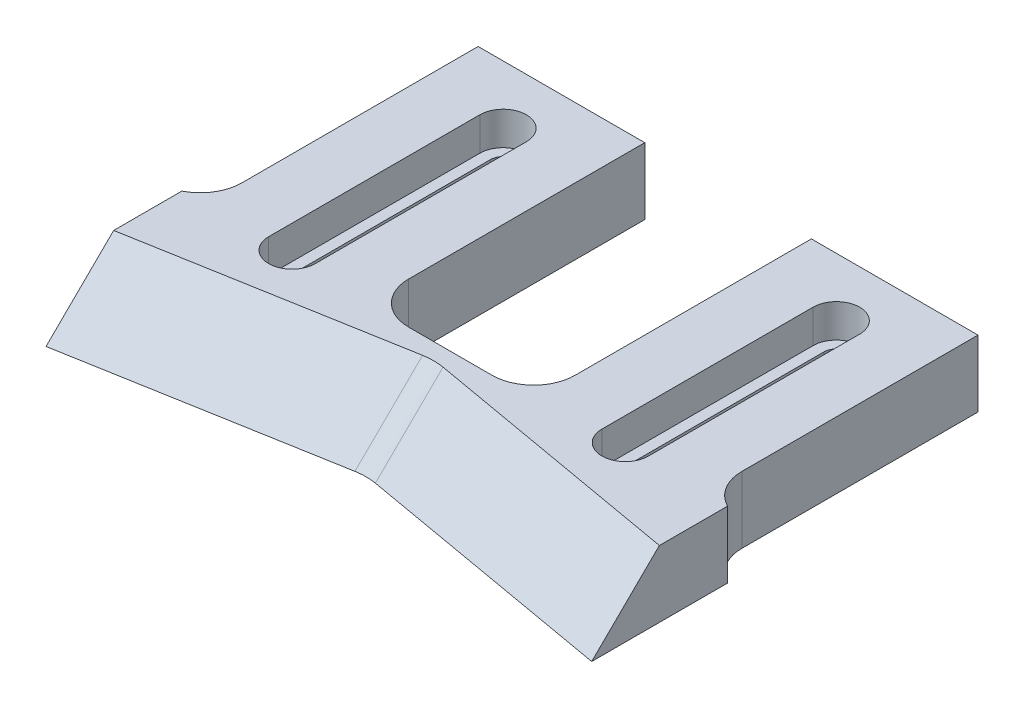
ISO-10303-21;
HEADER;
FILE_DESCRIPTION(('STEP AP214'),'2;1');
FILE_NAME('part.step','',(''),(''),'','','');
FILE_SCHEMA(('AUTOMOTIVE_DESIGN { 1 0 10303 214 1 1 1 1 }'));
ENDSEC;
DATA;
#1=APPLICATION_CONTEXT('core data for automotive mechanical design processes');
#2=APPLICATION_PROTOCOL_DEFINITION('international standard','automotive_design',2000,#1);
#3=PRODUCT_CONTEXT('',#1,'mechanical');
#4=PRODUCT('Part','Part','',(#3));
#5=PRODUCT_RELATED_PRODUCT_CATEGORY('part','',(#4));
#6=PRODUCT_DEFINITION_FORMATION('','',#4);
#7=PRODUCT_DEFINITION_CONTEXT('part definition',#1,'design');
#8=PRODUCT_DEFINITION('design','',#6,#7);
#9=PRODUCT_DEFINITION_SHAPE('','',#8);
#10=(LENGTH_UNIT() NAMED_UNIT(*) SI_UNIT(.MILLI.,.METRE.));
#11=(NAMED_UNIT(*) PLANE_ANGLE_UNIT() SI_UNIT($,.RADIAN.));
#12=(NAMED_UNIT(*) SI_UNIT($,.STERADIAN.) SOLID_ANGLE_UNIT());
#13=UNCERTAINTY_MEASURE_WITH_UNIT(LENGTH_MEASURE(1.E-05),#10,'distance_accuracy_value','');
#14=(GEOMETRIC_REPRESENTATION_CONTEXT(3) GLOBAL_UNCERTAINTY_ASSIGNED_CONTEXT((#13)) GLOBAL_UNIT_ASSIGNED_CONTEXT((#10,
#11,#12)) REPRESENTATION_CONTEXT('',''));
#15=CARTESIAN_POINT('',(0.,0.,0.));
#16=DIRECTION('',(0.,0.,1.));
#17=DIRECTION('',(1.,0.,0.));
#18=AXIS2_PLACEMENT_3D('',#15,#16,#17);
#19=CARTESIAN_POINT('',(57.75,-0.000999999999999265,-43.));
#20=DIRECTION('',(0.,1.,0.));
#21=DIRECTION('',(0.,0.,1.));
#22=AXIS2_PLACEMENT_3D('',#19,#20,#21);
#23=CYLINDRICAL_SURFACE('',#22,1.50000000000001);
#24=CARTESIAN_POINT('',(57.75,4.,-43.));
#25=DIRECTION('',(0.,1.,0.));
#26=DIRECTION('',(0.,0.,1.));
#27=AXIS2_PLACEMENT_3D('',#24,#25,#26);
#28=CIRCLE('',#27,1.50000000000001);
#29=CARTESIAN_POINT('',(56.25,4.,-43.));
#30=VERTEX_POINT('',#29);
#31=CARTESIAN_POINT('',(59.25,4.,-43.));
#32=VERTEX_POINT('',#31);
#33=EDGE_CURVE('E388',#30,#32,#28,.F.);
#34=ORIENTED_EDGE('',*,*,#33,.F.);
#35=DIRECTION('',(0.,1.,0.));
#36=VECTOR('',#35,1.);
#37=CARTESIAN_POINT('',(56.25,-0.000999999999999265,-43.));
#38=LINE('',#37,#36);
#39=CARTESIAN_POINT('',(56.25,0.,-43.));
#40=VERTEX_POINT('',#39);
#41=EDGE_CURVE('E460',#40,#30,#38,.T.);
#42=ORIENTED_EDGE('',*,*,#41,.F.);
#43=CARTESIAN_POINT('',(57.75,0.,-43.));
#44=DIRECTION('',(0.,-1.,0.));
#45=DIRECTION('',(0.,0.,-1.));
#46=AXIS2_PLACEMENT_3D('',#43,#44,#45);
#47=CIRCLE('',#46,1.50000000000001);
#48=CARTESIAN_POINT('',(59.25,0.,-43.));
#49=VERTEX_POINT('',#48);
#50=EDGE_CURVE('E457',#49,#40,#47,.F.);
#51=ORIENTED_EDGE('',*,*,#50,.F.);
#52=DIRECTION('',(0.,1.,0.));
#53=VECTOR('',#52,1.);
#54=CARTESIAN_POINT('',(59.25,-0.000999999999999265,-43.));
#55=LINE('',#54,#53);
#56=EDGE_CURVE('E461',#49,#32,#55,.T.);
#57=ORIENTED_EDGE('',*,*,#56,.T.);
#58=EDGE_LOOP('',(#34,#42,#51,#57));
#59=FACE_BOUND('',#58,.T.);
#60=ADVANCED_FACE('F37',(#59),#23,.F.);
#61=CARTESIAN_POINT('',(59.25,-0.000999999999999265,-43.));
#62=DIRECTION('',(1.,0.,0.));
#63=DIRECTION('',(0.,0.,-1.));
#64=AXIS2_PLACEMENT_3D('',#61,#62,#63);
#65=PLANE('',#64);
#66=DIRECTION('',(0.,0.,1.));
#67=VECTOR('',#66,1.);
#68=CARTESIAN_POINT('',(59.25,4.,-43.));
#69=LINE('',#68,#67);
#70=CARTESIAN_POINT('',(59.25,4.,-17.6563435217447));
#71=VERTEX_POINT('',#70);
#72=EDGE_CURVE('E386',#32,#71,#69,.T.);
#73=ORIENTED_EDGE('',*,*,#72,.F.);
#74=ORIENTED_EDGE('',*,*,#56,.F.);
#75=DIRECTION('',(0.,0.,-1.));
#76=VECTOR('',#75,1.);
#77=CARTESIAN_POINT('',(59.25,0.,-43.));
#78=LINE('',#77,#76);
#79=CARTESIAN_POINT('',(59.25,0.,-17.6563435217447));
#80=VERTEX_POINT('',#79);
#81=EDGE_CURVE('E454',#80,#49,#78,.T.);
#82=ORIENTED_EDGE('',*,*,#81,.F.);
#83=DIRECTION('',(0.,1.,0.));
#84=VECTOR('',#83,1.);
#85=CARTESIAN_POINT('',(59.25,-0.000999999999999265,-17.6563435217447));
#86=LINE('',#85,#84);
#87=EDGE_CURVE('E465',#80,#71,#86,.T.);
#88=ORIENTED_EDGE('',*,*,#87,.T.);
#89=EDGE_LOOP('',(#73,#74,#82,#88));
#90=FACE_BOUND('',#89,.T.);
#91=ADVANCED_FACE('F530',(#90),#65,.F.);
#92=CARTESIAN_POINT('',(57.75,-0.000999999999999265,-17.6563435217447));
#93=DIRECTION('',(0.,1.,0.));
#94=DIRECTION('',(0.,0.,1.));
#95=AXIS2_PLACEMENT_3D('',#92,#93,#94);
#96=CYLINDRICAL_SURFACE('',#95,1.5);
#97=CARTESIAN_POINT('',(57.75,4.,-17.6563435217447));
#98=DIRECTION('',(0.,1.,0.));
#99=DIRECTION('',(0.,0.,1.));
#100=AXIS2_PLACEMENT_3D('',#97,#98,#99);
#101=CIRCLE('',#100,1.5);
#102=CARTESIAN_POINT('',(56.25,4.,-17.6563435217447));
#103=VERTEX_POINT('',#102);
#104=EDGE_CURVE('E378',#71,#103,#101,.F.);
#105=ORIENTED_EDGE('',*,*,#104,.F.);
#106=ORIENTED_EDGE('',*,*,#87,.F.);
#107=CARTESIAN_POINT('',(57.75,0.,-17.6563435217447));
#108=DIRECTION('',(0.,-1.,0.));
#109=DIRECTION('',(0.,0.,-1.));
#110=AXIS2_PLACEMENT_3D('',#107,#108,#109);
#111=CIRCLE('',#110,1.5);
#112=CARTESIAN_POINT('',(56.25,0.,-17.6563435217447));
#113=VERTEX_POINT('',#112);
#114=EDGE_CURVE('E449',#113,#80,#111,.F.);
#115=ORIENTED_EDGE('',*,*,#114,.F.);
#116=DIRECTION('',(0.,1.,0.));
#117=VECTOR('',#116,1.);
#118=CARTESIAN_POINT('',(56.25,-0.000999999999999265,-17.6563435217447));
#119=LINE('',#118,#117);
#120=EDGE_CURVE('E468',#113,#103,#119,.T.);
#121=ORIENTED_EDGE('',*,*,#120,.T.);
#122=EDGE_LOOP('',(#105,#106,#115,#121));
#123=FACE_BOUND('',#122,.T.);
#124=ADVANCED_FACE('F536',(#123),#96,.F.);
#125=CARTESIAN_POINT('',(56.25,-0.000999999999999265,-43.));
#126=DIRECTION('',(-1.,0.,0.));
#127=DIRECTION('',(0.,0.,1.));
#128=AXIS2_PLACEMENT_3D('',#125,#126,#127);
#129=PLANE('',#128);
#130=DIRECTION('',(0.,0.,-1.));
#131=VECTOR('',#130,1.);
#132=CARTESIAN_POINT('',(56.25,4.,-43.));
#133=LINE('',#132,#131);
#134=EDGE_CURVE('E327',#103,#30,#133,.T.);
#135=ORIENTED_EDGE('',*,*,#134,.F.);
#136=ORIENTED_EDGE('',*,*,#120,.F.);
#137=DIRECTION('',(0.,0.,1.));
#138=VECTOR('',#137,1.);
#139=CARTESIAN_POINT('',(56.25,0.,-43.));
#140=LINE('',#139,#138);
#141=EDGE_CURVE('E464',#40,#113,#140,.T.);
#142=ORIENTED_EDGE('',*,*,#141,.F.);
#143=ORIENTED_EDGE('',*,*,#41,.T.);
#144=EDGE_LOOP('',(#135,#136,#142,#143));
#145=FACE_BOUND('',#144,.T.);
#146=ADVANCED_FACE('F542',(#145),#129,.F.);
#147=CARTESIAN_POINT('',(17.75,-0.000999999999999265,-43.));
#148=DIRECTION('',(0.,1.,0.));
#149=DIRECTION('',(0.,0.,1.));
#150=AXIS2_PLACEMENT_3D('',#147,#148,#149);
#151=CYLINDRICAL_SURFACE('',#150,1.5);
#152=CARTESIAN_POINT('',(17.75,4.,-43.));
#153=DIRECTION('',(0.,1.,0.));
#154=DIRECTION('',(0.,0.,1.));
#155=AXIS2_PLACEMENT_3D('',#152,#153,#154);
#156=CIRCLE('',#155,1.5);
#157=CARTESIAN_POINT('',(16.25,4.,-43.));
#158=VERTEX_POINT('',#157);
#159=CARTESIAN_POINT('',(19.25,4.,-43.));
#160=VERTEX_POINT('',#159);
#161=EDGE_CURVE('E426',#158,#160,#156,.F.);
#162=ORIENTED_EDGE('',*,*,#161,.F.);
#163=DIRECTION('',(0.,1.,0.));
#164=VECTOR('',#163,1.);
#165=CARTESIAN_POINT('',(16.25,-0.000999999999999265,-43.));
#166=LINE('',#165,#164);
#167=CARTESIAN_POINT('',(16.25,0.,-43.));
#168=VERTEX_POINT('',#167);
#169=EDGE_CURVE('E484',#168,#158,#166,.T.);
#170=ORIENTED_EDGE('',*,*,#169,.F.);
#171=CARTESIAN_POINT('',(17.75,0.,-43.));
#172=DIRECTION('',(0.,-1.,0.));
#173=DIRECTION('',(0.,0.,-1.));
#174=AXIS2_PLACEMENT_3D('',#171,#172,#173);
#175=CIRCLE('',#174,1.5);
#176=CARTESIAN_POINT('',(19.25,0.,-43.));
#177=VERTEX_POINT('',#176);
#178=EDGE_CURVE('E481',#177,#168,#175,.F.);
#179=ORIENTED_EDGE('',*,*,#178,.F.);
#180=DIRECTION('',(0.,1.,0.));
#181=VECTOR('',#180,1.);
#182=CARTESIAN_POINT('',(19.25,-0.000999999999999265,-43.));
#183=LINE('',#182,#181);
#184=EDGE_CURVE('E485',#177,#160,#183,.T.);
#185=ORIENTED_EDGE('',*,*,#184,.T.);
#186=EDGE_LOOP('',(#162,#170,#179,#185));
#187=FACE_BOUND('',#186,.T.);
#188=ADVANCED_FACE('F548',(#187),#151,.F.);
#189=CARTESIAN_POINT('',(19.25,-0.000999999999999265,-43.));
#190=DIRECTION('',(1.,0.,0.));
#191=DIRECTION('',(0.,0.,-1.));
#192=AXIS2_PLACEMENT_3D('',#189,#190,#191);
#193=PLANE('',#192);
#194=DIRECTION('',(0.,0.,1.));
#195=VECTOR('',#194,1.);
#196=CARTESIAN_POINT('',(19.25,4.,-43.));
#197=LINE('',#196,#195);
#198=CARTESIAN_POINT('',(19.25,4.,-17.6563435217447));
#199=VERTEX_POINT('',#198);
#200=EDGE_CURVE('E424',#160,#199,#197,.T.);
#201=ORIENTED_EDGE('',*,*,#200,.F.);
#202=ORIENTED_EDGE('',*,*,#184,.F.);
#203=DIRECTION('',(0.,0.,-1.));
#204=VECTOR('',#203,1.);
#205=CARTESIAN_POINT('',(19.25,0.,-43.));
#206=LINE('',#205,#204);
#207=CARTESIAN_POINT('',(19.25,0.,-17.6563435217447));
#208=VERTEX_POINT('',#207);
#209=EDGE_CURVE('E478',#208,#177,#206,.T.);
#210=ORIENTED_EDGE('',*,*,#209,.F.);
#211=DIRECTION('',(0.,1.,0.));
#212=VECTOR('',#211,1.);
#213=CARTESIAN_POINT('',(19.25,-0.000999999999999265,-17.6563435217447));
#214=LINE('',#213,#212);
#215=EDGE_CURVE('E488',#208,#199,#214,.T.);
#216=ORIENTED_EDGE('',*,*,#215,.T.);
#217=EDGE_LOOP('',(#201,#202,#210,#216));
#218=FACE_BOUND('',#217,.T.);
#219=ADVANCED_FACE('F544',(#218),#193,.F.);
#220=CARTESIAN_POINT('',(17.75,-0.000999999999999265,-17.6563435217447));
#221=DIRECTION('',(0.,1.,0.));
#222=DIRECTION('',(0.,0.,1.));
#223=AXIS2_PLACEMENT_3D('',#220,#221,#222);
#224=CYLINDRICAL_SURFACE('',#223,1.5);
#225=CARTESIAN_POINT('',(17.75,4.,-17.6563435217447));
#226=DIRECTION('',(0.,1.,0.));
#227=DIRECTION('',(0.,0.,1.));
#228=AXIS2_PLACEMENT_3D('',#225,#226,#227);
#229=CIRCLE('',#228,1.5);
#230=CARTESIAN_POINT('',(16.25,4.,-17.6563435217447));
#231=VERTEX_POINT('',#230);
#232=EDGE_CURVE('E416',#199,#231,#229,.F.);
#233=ORIENTED_EDGE('',*,*,#232,.F.);
#234=ORIENTED_EDGE('',*,*,#215,.F.);
#235=CARTESIAN_POINT('',(17.75,0.,-17.6563435217447));
#236=DIRECTION('',(0.,-1.,0.));
#237=DIRECTION('',(0.,0.,-1.));
#238=AXIS2_PLACEMENT_3D('',#235,#236,#237);
#239=CIRCLE('',#238,1.5);
#240=CARTESIAN_POINT('',(16.25,0.,-17.6563435217447));
#241=VERTEX_POINT('',#240);
#242=EDGE_CURVE('E475',#241,#208,#239,.F.);
#243=ORIENTED_EDGE('',*,*,#242,.F.);
#244=DIRECTION('',(0.,1.,0.));
#245=VECTOR('',#244,1.);
#246=CARTESIAN_POINT('',(16.25,-0.000999999999999265,-17.6563435217447));
#247=LINE('',#246,#245);
#248=EDGE_CURVE('E491',#241,#231,#247,.T.);
#249=ORIENTED_EDGE('',*,*,#248,.T.);
#250=EDGE_LOOP('',(#233,#234,#243,#249));
#251=FACE_BOUND('',#250,.T.);
#252=ADVANCED_FACE('F547',(#251),#224,.F.);
#253=CARTESIAN_POINT('',(16.25,-0.000999999999999265,-43.));
#254=DIRECTION('',(-1.,0.,0.));
#255=DIRECTION('',(0.,0.,1.));
#256=AXIS2_PLACEMENT_3D('',#253,#254,#255);
#257=PLANE('',#256);
#258=DIRECTION('',(0.,0.,-1.));
#259=VECTOR('',#258,1.);
#260=CARTESIAN_POINT('',(16.25,4.,-43.));
#261=LINE('',#260,#259);
#262=EDGE_CURVE('E325',#231,#158,#261,.T.);
#263=ORIENTED_EDGE('',*,*,#262,.F.);
#264=ORIENTED_EDGE('',*,*,#248,.F.);
#265=DIRECTION('',(0.,0.,1.));
#266=VECTOR('',#265,1.);
#267=CARTESIAN_POINT('',(16.25,0.,-43.));
#268=LINE('',#267,#266);
#269=EDGE_CURVE('E275',#168,#241,#268,.T.);
#270=ORIENTED_EDGE('',*,*,#269,.F.);
#271=ORIENTED_EDGE('',*,*,#169,.T.);
#272=EDGE_LOOP('',(#263,#264,#270,#271));
#273=FACE_BOUND('',#272,.T.);
#274=ADVANCED_FACE('F552',(#273),#257,.F.);
#275=CARTESIAN_POINT('',(0.,8.,-50.));
#276=DIRECTION('',(0.,0.,1.));
#277=DIRECTION('',(1.,0.,0.));
#278=AXIS2_PLACEMENT_3D('',#275,#276,#277);
#279=PLANE('',#278);
#280=DIRECTION('',(-1.,0.,0.));
#281=VECTOR('',#280,1.);
#282=CARTESIAN_POINT('',(0.,0.,-50.));
#283=LINE('',#282,#281);
#284=CARTESIAN_POINT('',(27.75,0.,-50.));
#285=VERTEX_POINT('',#284);
#286=CARTESIAN_POINT('',(7.74999999999998,0.,-50.));
#287=VERTEX_POINT('',#286);
#288=EDGE_CURVE('E269',#285,#287,#283,.T.);
#289=ORIENTED_EDGE('',*,*,#288,.T.);
#290=DIRECTION('',(0.,1.,0.));
#291=VECTOR('',#290,1.);
#292=CARTESIAN_POINT('',(7.74999999999998,-2.,-50.));
#293=LINE('',#292,#291);
#294=CARTESIAN_POINT('',(7.74999999999998,8.,-50.));
#295=VERTEX_POINT('',#294);
#296=EDGE_CURVE('E435',#287,#295,#293,.T.);
#297=ORIENTED_EDGE('',*,*,#296,.T.);
#298=DIRECTION('',(-1.,0.,0.));
#299=VECTOR('',#298,1.);
#300=CARTESIAN_POINT('',(0.,8.,-50.));
#301=LINE('',#300,#299);
#302=CARTESIAN_POINT('',(27.75,8.,-50.));
#303=VERTEX_POINT('',#302);
#304=EDGE_CURVE('E279',#303,#295,#301,.T.);
#305=ORIENTED_EDGE('',*,*,#304,.F.);
#306=DIRECTION('',(0.,1.,0.));
#307=VECTOR('',#306,1.);
#308=CARTESIAN_POINT('',(27.75,-2.,-50.));
#309=LINE('',#308,#307);
#310=EDGE_CURVE('E447',#285,#303,#309,.T.);
#311=ORIENTED_EDGE('',*,*,#310,.F.);
#312=EDGE_LOOP('',(#289,#297,#305,#311));
#313=FACE_BOUND('',#312,.T.);
#314=ADVANCED_FACE('F509',(#313),#279,.F.);
#315=CARTESIAN_POINT('',(67.75,8.,-50.));
#316=VERTEX_POINT('',#315);
#317=CARTESIAN_POINT('',(47.75,8.,-50.));
#318=VERTEX_POINT('',#317);
#319=EDGE_CURVE('E284',#316,#318,#301,.T.);
#320=ORIENTED_EDGE('',*,*,#319,.F.);
#321=DIRECTION('',(0.,1.,0.));
#322=VECTOR('',#321,1.);
#323=CARTESIAN_POINT('',(67.75,-2.,-50.));
#324=LINE('',#323,#322);
#325=CARTESIAN_POINT('',(67.75,0.,-50.));
#326=VERTEX_POINT('',#325);
#327=EDGE_CURVE('E431',#326,#316,#324,.T.);
#328=ORIENTED_EDGE('',*,*,#327,.F.);
#329=CARTESIAN_POINT('',(47.75,0.,-50.));
#330=VERTEX_POINT('',#329);
#331=EDGE_CURVE('E273',#326,#330,#283,.T.);
#332=ORIENTED_EDGE('',*,*,#331,.T.);
#333=DIRECTION('',(0.,1.,0.));
#334=VECTOR('',#333,1.);
#335=CARTESIAN_POINT('',(47.75,-2.,-50.));
#336=LINE('',#335,#334);
#337=EDGE_CURVE('E446',#330,#318,#336,.T.);
#338=ORIENTED_EDGE('',*,*,#337,.T.);
#339=EDGE_LOOP('',(#320,#328,#332,#338));
#340=FACE_BOUND('',#339,.T.);
#341=ADVANCED_FACE('F562',(#340),#279,.F.);
#342=CARTESIAN_POINT('',(0.,8.,0.));
#343=DIRECTION('',(0.,-1.,0.));
#344=DIRECTION('',(0.,0.,-1.));
#345=AXIS2_PLACEMENT_3D('',#342,#343,#344);
#346=PLANE('',#345);
#347=DIRECTION('',(0.,0.,1.));
#348=VECTOR('',#347,1.);
#349=CARTESIAN_POINT('',(54.95,8.,-43.));
#350=LINE('',#349,#348);
#351=CARTESIAN_POINT('',(54.95,8.,-43.));
#352=VERTEX_POINT('',#351);
#353=CARTESIAN_POINT('',(54.95,8.,-17.6563435217447));
#354=VERTEX_POINT('',#353);
#355=EDGE_CURVE('E368',#352,#354,#350,.T.);
#356=ORIENTED_EDGE('',*,*,#355,.F.);
#357=CARTESIAN_POINT('',(57.75,8.,-43.));
#358=DIRECTION('',(0.,1.,0.));
#359=DIRECTION('',(0.,0.,1.));
#360=AXIS2_PLACEMENT_3D('',#357,#358,#359);
#361=CIRCLE('',#360,2.8);
#362=CARTESIAN_POINT('',(60.55,8.,-43.));
#363=VERTEX_POINT('',#362);
#364=EDGE_CURVE('E352',#363,#352,#361,.T.);
#365=ORIENTED_EDGE('',*,*,#364,.F.);
#366=DIRECTION('',(0.,0.,-1.));
#367=VECTOR('',#366,1.);
#368=CARTESIAN_POINT('',(60.55,8.,-43.));
#369=LINE('',#368,#367);
#370=CARTESIAN_POINT('',(60.55,8.,-17.6563435217447));
#371=VERTEX_POINT('',#370);
#372=EDGE_CURVE('E357',#371,#363,#369,.T.);
#373=ORIENTED_EDGE('',*,*,#372,.F.);
#374=CARTESIAN_POINT('',(57.75,8.,-17.6563435217447));
#375=DIRECTION('',(0.,1.,0.));
#376=DIRECTION('',(0.,0.,1.));
#377=AXIS2_PLACEMENT_3D('',#374,#375,#376);
#378=CIRCLE('',#377,2.79999999999999);
#379=EDGE_CURVE('E371',#354,#371,#378,.T.);
#380=ORIENTED_EDGE('',*,*,#379,.F.);
#381=EDGE_LOOP('',(#356,#365,#373,#380));
#382=FACE_BOUND('',#381,.T.);
#383=DIRECTION('',(0.,0.,1.));
#384=VECTOR('',#383,1.);
#385=CARTESIAN_POINT('',(14.95,8.,-43.));
#386=LINE('',#385,#384);
#387=CARTESIAN_POINT('',(14.95,8.,-43.));
#388=VERTEX_POINT('',#387);
#389=CARTESIAN_POINT('',(14.95,8.,-17.6563435217447));
#390=VERTEX_POINT('',#389);
#391=EDGE_CURVE('E406',#388,#390,#386,.T.);
#392=ORIENTED_EDGE('',*,*,#391,.F.);
#393=CARTESIAN_POINT('',(17.75,8.,-43.));
#394=DIRECTION('',(0.,1.,0.));
#395=DIRECTION('',(0.,0.,1.));
#396=AXIS2_PLACEMENT_3D('',#393,#394,#395);
#397=CIRCLE('',#396,2.8);
#398=CARTESIAN_POINT('',(20.55,8.,-43.));
#399=VERTEX_POINT('',#398);
#400=EDGE_CURVE('E390',#399,#388,#397,.T.);
#401=ORIENTED_EDGE('',*,*,#400,.F.);
#402=DIRECTION('',(0.,0.,-1.));
#403=VECTOR('',#402,1.);
#404=CARTESIAN_POINT('',(20.55,8.,-43.));
#405=LINE('',#404,#403);
#406=CARTESIAN_POINT('',(20.55,8.,-17.6563435217447));
#407=VERTEX_POINT('',#406);
#408=EDGE_CURVE('E395',#407,#399,#405,.T.);
#409=ORIENTED_EDGE('',*,*,#408,.F.);
#410=CARTESIAN_POINT('',(17.75,8.,-17.6563435217447));
#411=DIRECTION('',(0.,1.,0.));
#412=DIRECTION('',(0.,0.,1.));
#413=AXIS2_PLACEMENT_3D('',#410,#411,#412);
#414=CIRCLE('',#413,2.79999999999999);
#415=EDGE_CURVE('E409',#390,#407,#414,.T.);
#416=ORIENTED_EDGE('',*,*,#415,.F.);
#417=EDGE_LOOP('',(#392,#401,#409,#416));
#418=FACE_BOUND('',#417,.T.);
#419=DIRECTION('',(0.984807753012207,0.,0.173648177666935));
#420=VECTOR('',#419,1.);
#421=CARTESIAN_POINT('',(3.66578898666755,8.,-20.789722434642));
#422=LINE('',#421,#420);
#423=CARTESIAN_POINT('',(38.9778780396898,8.,-14.5632483894139));
#424=VERTEX_POINT('',#423);
#425=CARTESIAN_POINT('',(70.5,8.,-9.0050477986283));
#426=VERTEX_POINT('',#425);
#427=EDGE_CURVE('E331',#424,#426,#422,.T.);
#428=ORIENTED_EDGE('',*,*,#427,.T.);
#429=DIRECTION('',(0.,0.,1.));
#430=VECTOR('',#429,1.);
#431=CARTESIAN_POINT('',(70.5,8.,0.));
#432=LINE('',#431,#430);
#433=CARTESIAN_POINT('',(70.5,8.,-17.1912007468718));
#434=VERTEX_POINT('',#433);
#435=EDGE_CURVE('E52',#434,#426,#432,.T.);
#436=ORIENTED_EDGE('',*,*,#435,.F.);
#437=CARTESIAN_POINT('',(72.75,8.,-21.6563435217447));
#438=DIRECTION('',(0.,-1.,0.));
#439=DIRECTION('',(0.,0.,-1.));
#440=AXIS2_PLACEMENT_3D('',#437,#438,#439);
#441=CIRCLE('',#440,5.);
#442=CARTESIAN_POINT('',(67.75,8.,-21.6563435217447));
#443=VERTEX_POINT('',#442);
#444=EDGE_CURVE('E309',#434,#443,#441,.T.);
#445=ORIENTED_EDGE('',*,*,#444,.T.);
#446=DIRECTION('',(0.,0.,1.));
#447=VECTOR('',#446,1.);
#448=CARTESIAN_POINT('',(67.75,8.,-50.));
#449=LINE('',#448,#447);
#450=EDGE_CURVE('E428',#316,#443,#449,.T.);
#451=ORIENTED_EDGE('',*,*,#450,.F.);
#452=ORIENTED_EDGE('',*,*,#319,.T.);
#453=DIRECTION('',(0.,0.,-1.));
#454=VECTOR('',#453,1.);
#455=CARTESIAN_POINT('',(47.75,8.,-50.));
#456=LINE('',#455,#454);
#457=CARTESIAN_POINT('',(47.75,8.,-21.6563435217447));
#458=VERTEX_POINT('',#457);
#459=EDGE_CURVE('E444',#458,#318,#456,.T.);
#460=ORIENTED_EDGE('',*,*,#459,.F.);
#461=CARTESIAN_POINT('',(42.75,8.,-21.6563435217447));
#462=DIRECTION('',(0.,-1.,0.));
#463=DIRECTION('',(0.,0.,-1.));
#464=AXIS2_PLACEMENT_3D('',#461,#462,#463);
#465=CIRCLE('',#464,5.);
#466=CARTESIAN_POINT('',(42.75,8.,-16.6563435217447));
#467=VERTEX_POINT('',#466);
#468=EDGE_CURVE('E312',#458,#467,#465,.T.);
#469=ORIENTED_EDGE('',*,*,#468,.T.);
#470=DIRECTION('',(1.,0.,0.));
#471=VECTOR('',#470,1.);
#472=CARTESIAN_POINT('',(27.75,8.,-16.6563435217447));
#473=LINE('',#472,#471);
#474=CARTESIAN_POINT('',(32.75,8.,-16.6563435217447));
#475=VERTEX_POINT('',#474);
#476=EDGE_CURVE('E441',#475,#467,#473,.T.);
#477=ORIENTED_EDGE('',*,*,#476,.F.);
#478=CARTESIAN_POINT('',(32.75,8.,-21.6563435217447));
#479=DIRECTION('',(0.,-1.,0.));
#480=DIRECTION('',(0.,0.,-1.));
#481=AXIS2_PLACEMENT_3D('',#478,#479,#480);
#482=CIRCLE('',#481,5.);
#483=CARTESIAN_POINT('',(27.75,8.,-21.6563435217447));
#484=VERTEX_POINT('',#483);
#485=EDGE_CURVE('E316',#475,#484,#482,.T.);
#486=ORIENTED_EDGE('',*,*,#485,.T.);
#487=DIRECTION('',(0.,0.,1.));
#488=VECTOR('',#487,1.);
#489=CARTESIAN_POINT('',(27.75,8.,-50.));
#490=LINE('',#489,#488);
#491=EDGE_CURVE('E438',#303,#484,#490,.T.);
#492=ORIENTED_EDGE('',*,*,#491,.F.);
#493=ORIENTED_EDGE('',*,*,#304,.T.);
#494=DIRECTION('',(0.,0.,-1.));
#495=VECTOR('',#494,1.);
#496=CARTESIAN_POINT('',(7.74999999999998,8.,-50.));
#497=LINE('',#496,#495);
#498=CARTESIAN_POINT('',(7.74999999999999,8.,-21.6563435217447));
#499=VERTEX_POINT('',#498);
#500=EDGE_CURVE('E433',#499,#295,#497,.T.);
#501=ORIENTED_EDGE('',*,*,#500,.F.);
#502=CARTESIAN_POINT('',(2.74999999999999,8.,-21.6563435217447));
#503=DIRECTION('',(0.,-1.,0.));
#504=DIRECTION('',(0.,0.,-1.));
#505=AXIS2_PLACEMENT_3D('',#502,#503,#504);
#506=CIRCLE('',#505,5.);
#507=CARTESIAN_POINT('',(5.,8.,-17.1912007468718));
#508=VERTEX_POINT('',#507);
#509=EDGE_CURVE('E320',#499,#508,#506,.T.);
#510=ORIENTED_EDGE('',*,*,#509,.T.);
#511=DIRECTION('',(0.,0.,-1.));
#512=VECTOR('',#511,1.);
#513=CARTESIAN_POINT('',(5.,8.,0.));
#514=LINE('',#513,#512);
#515=CARTESIAN_POINT('',(5.,8.,-9.0050477986283));
#516=VERTEX_POINT('',#515);
#517=EDGE_CURVE('E350',#516,#508,#514,.T.);
#518=ORIENTED_EDGE('',*,*,#517,.F.);
#519=DIRECTION('',(0.984807753012207,0.,-0.173648177666935));
#520=VECTOR('',#519,1.);
#521=CARTESIAN_POINT('',(-1.38918542133548,8.,-7.87846202409764));
#522=LINE('',#521,#520);
#523=CARTESIAN_POINT('',(36.5221219603103,8.,-14.563248389414));
#524=VERTEX_POINT('',#523);
#525=EDGE_CURVE('E329',#516,#524,#522,.T.);
#526=ORIENTED_EDGE('',*,*,#525,.T.);
#527=CARTESIAN_POINT('',(37.75,8.,-0.419455555596891));
#528=DIRECTION('',(0.,-1.,0.));
#529=DIRECTION('',(0.,0.,-1.));
#530=AXIS2_PLACEMENT_3D('',#527,#528,#529);
#531=ELLIPSE('',#530,14.2516357100712,10.);
#532=EDGE_CURVE('E11',#524,#424,#531,.T.);
#533=ORIENTED_EDGE('',*,*,#532,.T.);
#534=EDGE_LOOP('',(#428,#436,#445,#451,#452,#460,#469,#477,#486,#492,#493,#501,#510,#518,#526,#533));
#535=FACE_BOUND('',#534,.T.);
#536=ADVANCED_FACE('F506',(#382,#418,#535),#346,.F.);
#537=CARTESIAN_POINT('',(0.,0.,0.));
#538=DIRECTION('',(0.,-1.,0.));
#539=DIRECTION('',(0.,0.,-1.));
#540=AXIS2_PLACEMENT_3D('',#537,#538,#539);
#541=PLANE('',#540);
#542=DIRECTION('',(0.,0.,1.));
#543=VECTOR('',#542,1.);
#544=CARTESIAN_POINT('',(70.5,0.,0.));
#545=LINE('',#544,#543);
#546=CARTESIAN_POINT('',(70.5,0.,-17.1912007468718));
#547=VERTEX_POINT('',#546);
#548=CARTESIAN_POINT('',(70.5,0.,-0.881634903542358));
#549=VERTEX_POINT('',#548);
#550=EDGE_CURVE('E245',#547,#549,#545,.T.);
#551=ORIENTED_EDGE('',*,*,#550,.T.);
#552=DIRECTION('',(0.984807753012207,0.,0.173648177666935));
#553=VECTOR('',#552,1.);
#554=CARTESIAN_POINT('',(75.5,0.,0.));
#555=LINE('',#554,#553);
#556=CARTESIAN_POINT('',(38.9778780396898,0.,-6.43983549432799));
#557=VERTEX_POINT('',#556);
#558=EDGE_CURVE('E259',#557,#549,#555,.T.);
#559=ORIENTED_EDGE('',*,*,#558,.F.);
#560=CARTESIAN_POINT('',(37.75,0.,7.70395733948903));
#561=DIRECTION('',(0.,-1.,0.));
#562=DIRECTION('',(0.,0.,-1.));
#563=AXIS2_PLACEMENT_3D('',#560,#561,#562);
#564=ELLIPSE('',#563,14.2516357100712,10.);
#565=CARTESIAN_POINT('',(36.5221219603103,0.,-6.439835494328));
#566=VERTEX_POINT('',#565);
#567=EDGE_CURVE('E45',#557,#566,#564,.F.);
#568=ORIENTED_EDGE('',*,*,#567,.T.);
#569=DIRECTION('',(0.984807753012207,0.,-0.173648177666935));
#570=VECTOR('',#569,1.);
#571=CARTESIAN_POINT('',(37.75,0.,-6.65634352174472));
#572=LINE('',#571,#570);
#573=CARTESIAN_POINT('',(5.,0.,-0.881634903542355));
#574=VERTEX_POINT('',#573);
#575=EDGE_CURVE('E270',#574,#566,#572,.T.);
#576=ORIENTED_EDGE('',*,*,#575,.F.);
#577=DIRECTION('',(0.,0.,-1.));
#578=VECTOR('',#577,1.);
#579=CARTESIAN_POINT('',(5.,0.,0.));
#580=LINE('',#579,#578);
#581=CARTESIAN_POINT('',(5.,0.,-17.1912007468718));
#582=VERTEX_POINT('',#581);
#583=EDGE_CURVE('E60',#574,#582,#580,.T.);
#584=ORIENTED_EDGE('',*,*,#583,.T.);
#585=CARTESIAN_POINT('',(2.74999999999999,0.,-21.6563435217447));
#586=DIRECTION('',(0.,-1.,0.));
#587=DIRECTION('',(0.,0.,-1.));
#588=AXIS2_PLACEMENT_3D('',#585,#586,#587);
#589=CIRCLE('',#588,5.);
#590=CARTESIAN_POINT('',(7.74999999999999,0.,-21.6563435217447));
#591=VERTEX_POINT('',#590);
#592=EDGE_CURVE('E323',#582,#591,#589,.F.);
#593=ORIENTED_EDGE('',*,*,#592,.T.);
#594=DIRECTION('',(0.,0.,1.));
#595=VECTOR('',#594,1.);
#596=CARTESIAN_POINT('',(7.74999999999999,0.,0.));
#597=LINE('',#596,#595);
#598=EDGE_CURVE('E289',#287,#591,#597,.T.);
#599=ORIENTED_EDGE('',*,*,#598,.F.);
#600=ORIENTED_EDGE('',*,*,#288,.F.);
#601=DIRECTION('',(0.,0.,-1.));
#602=VECTOR('',#601,1.);
#603=CARTESIAN_POINT('',(27.75,0.,0.));
#604=LINE('',#603,#602);
#605=CARTESIAN_POINT('',(27.75,0.,-21.6563435217447));
#606=VERTEX_POINT('',#605);
#607=EDGE_CURVE('E287',#606,#285,#604,.T.);
#608=ORIENTED_EDGE('',*,*,#607,.F.);
#609=CARTESIAN_POINT('',(32.75,0.,-21.6563435217447));
#610=DIRECTION('',(0.,-1.,0.));
#611=DIRECTION('',(0.,0.,-1.));
#612=AXIS2_PLACEMENT_3D('',#609,#610,#611);
#613=CIRCLE('',#612,5.);
#614=CARTESIAN_POINT('',(32.75,0.,-16.6563435217447));
#615=VERTEX_POINT('',#614);
#616=EDGE_CURVE('E318',#606,#615,#613,.F.);
#617=ORIENTED_EDGE('',*,*,#616,.T.);
#618=DIRECTION('',(-1.,0.,0.));
#619=VECTOR('',#618,1.);
#620=CARTESIAN_POINT('',(0.,0.,-16.6563435217447));
#621=LINE('',#620,#619);
#622=CARTESIAN_POINT('',(42.75,0.,-16.6563435217447));
#623=VERTEX_POINT('',#622);
#624=EDGE_CURVE('E280',#623,#615,#621,.T.);
#625=ORIENTED_EDGE('',*,*,#624,.F.);
#626=CARTESIAN_POINT('',(42.75,0.,-21.6563435217447));
#627=DIRECTION('',(0.,-1.,0.));
#628=DIRECTION('',(0.,0.,-1.));
#629=AXIS2_PLACEMENT_3D('',#626,#627,#628);
#630=CIRCLE('',#629,5.);
#631=CARTESIAN_POINT('',(47.75,0.,-21.6563435217447));
#632=VERTEX_POINT('',#631);
#633=EDGE_CURVE('E314',#623,#632,#630,.F.);
#634=ORIENTED_EDGE('',*,*,#633,.T.);
#635=DIRECTION('',(0.,0.,1.));
#636=VECTOR('',#635,1.);
#637=CARTESIAN_POINT('',(47.75,0.,0.));
#638=LINE('',#637,#636);
#639=EDGE_CURVE('E283',#330,#632,#638,.T.);
#640=ORIENTED_EDGE('',*,*,#639,.F.);
#641=ORIENTED_EDGE('',*,*,#331,.F.);
#642=DIRECTION('',(0.,0.,-1.));
#643=VECTOR('',#642,1.);
#644=CARTESIAN_POINT('',(67.75,0.,0.));
#645=LINE('',#644,#643);
#646=CARTESIAN_POINT('',(67.75,0.,-21.6563435217447));
#647=VERTEX_POINT('',#646);
#648=EDGE_CURVE('E292',#647,#326,#645,.T.);
#649=ORIENTED_EDGE('',*,*,#648,.F.);
#650=CARTESIAN_POINT('',(72.75,0.,-21.6563435217447));
#651=DIRECTION('',(0.,-1.,0.));
#652=DIRECTION('',(0.,0.,-1.));
#653=AXIS2_PLACEMENT_3D('',#650,#651,#652);
#654=CIRCLE('',#653,5.);
#655=EDGE_CURVE('E262',#647,#547,#654,.F.);
#656=ORIENTED_EDGE('',*,*,#655,.T.);
#657=EDGE_LOOP('',(#551,#559,#568,#576,#584,#593,#599,#600,#608,#617,#625,#634,#640,#641,#649,#656));
#658=FACE_BOUND('',#657,.T.);
#659=ORIENTED_EDGE('',*,*,#50,.T.);
#660=ORIENTED_EDGE('',*,*,#141,.T.);
#661=ORIENTED_EDGE('',*,*,#114,.T.);
#662=ORIENTED_EDGE('',*,*,#81,.T.);
#663=EDGE_LOOP('',(#659,#660,#661,#662));
#664=FACE_BOUND('',#663,.T.);
#665=ORIENTED_EDGE('',*,*,#178,.T.);
#666=ORIENTED_EDGE('',*,*,#269,.T.);
#667=ORIENTED_EDGE('',*,*,#242,.T.);
#668=ORIENTED_EDGE('',*,*,#209,.T.);
#669=EDGE_LOOP('',(#665,#666,#667,#668));
#670=FACE_BOUND('',#669,.T.);
#671=ADVANCED_FACE('F256',(#658,#664,#670),#541,.T.);
#672=CARTESIAN_POINT('',(27.75,-2.,-50.));
#673=DIRECTION('',(-1.,0.,0.));
#674=DIRECTION('',(0.,0.,1.));
#675=AXIS2_PLACEMENT_3D('',#672,#673,#674);
#676=PLANE('',#675);
#677=ORIENTED_EDGE('',*,*,#491,.T.);
#678=DIRECTION('',(0.,1.,0.));
#679=VECTOR('',#678,1.);
#680=CARTESIAN_POINT('',(27.75,0.,-21.6563435217447));
#681=LINE('',#680,#679);
#682=EDGE_CURVE('E304',#484,#606,#681,.F.);
#683=ORIENTED_EDGE('',*,*,#682,.T.);
#684=ORIENTED_EDGE('',*,*,#607,.T.);
#685=ORIENTED_EDGE('',*,*,#310,.T.);
#686=EDGE_LOOP('',(#677,#683,#684,#685));
#687=FACE_BOUND('',#686,.T.);
#688=ADVANCED_FACE('F566',(#687),#676,.F.);
#689=CARTESIAN_POINT('',(47.75,-2.,-50.));
#690=DIRECTION('',(1.,0.,0.));
#691=DIRECTION('',(0.,0.,-1.));
#692=AXIS2_PLACEMENT_3D('',#689,#690,#691);
#693=PLANE('',#692);
#694=ORIENTED_EDGE('',*,*,#639,.T.);
#695=DIRECTION('',(0.,1.,0.));
#696=VECTOR('',#695,1.);
#697=CARTESIAN_POINT('',(47.75,8.,-21.6563435217447));
#698=LINE('',#697,#696);
#699=EDGE_CURVE('E296',#632,#458,#698,.T.);
#700=ORIENTED_EDGE('',*,*,#699,.T.);
#701=ORIENTED_EDGE('',*,*,#459,.T.);
#702=ORIENTED_EDGE('',*,*,#337,.F.);
#703=EDGE_LOOP('',(#694,#700,#701,#702));
#704=FACE_BOUND('',#703,.T.);
#705=ADVANCED_FACE('F633',(#704),#693,.F.);
#706=CARTESIAN_POINT('',(27.75,-2.,-16.6563435217447));
#707=DIRECTION('',(0.,0.,1.));
#708=DIRECTION('',(1.,0.,0.));
#709=AXIS2_PLACEMENT_3D('',#706,#707,#708);
#710=PLANE('',#709);
#711=ORIENTED_EDGE('',*,*,#476,.T.);
#712=DIRECTION('',(0.,1.,0.));
#713=VECTOR('',#712,1.);
#714=CARTESIAN_POINT('',(42.75,0.,-16.6563435217447));
#715=LINE('',#714,#713);
#716=EDGE_CURVE('E302',#467,#623,#715,.F.);
#717=ORIENTED_EDGE('',*,*,#716,.T.);
#718=ORIENTED_EDGE('',*,*,#624,.T.);
#719=DIRECTION('',(0.,1.,0.));
#720=VECTOR('',#719,1.);
#721=CARTESIAN_POINT('',(32.75,8.,-16.6563435217447));
#722=LINE('',#721,#720);
#723=EDGE_CURVE('E299',#615,#475,#722,.T.);
#724=ORIENTED_EDGE('',*,*,#723,.T.);
#725=EDGE_LOOP('',(#711,#717,#718,#724));
#726=FACE_BOUND('',#725,.T.);
#727=ADVANCED_FACE('F632',(#726),#710,.F.);
#728=CARTESIAN_POINT('',(7.74999999999998,-2.,-50.));
#729=DIRECTION('',(1.,0.,0.));
#730=DIRECTION('',(0.,0.,-1.));
#731=AXIS2_PLACEMENT_3D('',#728,#729,#730);
#732=PLANE('',#731);
#733=ORIENTED_EDGE('',*,*,#598,.T.);
#734=DIRECTION('',(0.,1.,0.));
#735=VECTOR('',#734,1.);
#736=CARTESIAN_POINT('',(7.74999999999999,8.,-21.6563435217447));
#737=LINE('',#736,#735);
#738=EDGE_CURVE('E306',#591,#499,#737,.T.);
#739=ORIENTED_EDGE('',*,*,#738,.T.);
#740=ORIENTED_EDGE('',*,*,#500,.T.);
#741=ORIENTED_EDGE('',*,*,#296,.F.);
#742=EDGE_LOOP('',(#733,#739,#740,#741));
#743=FACE_BOUND('',#742,.T.);
#744=ADVANCED_FACE('F513',(#743),#732,.F.);
#745=CARTESIAN_POINT('',(67.75,-2.,-50.));
#746=DIRECTION('',(-1.,0.,0.));
#747=DIRECTION('',(0.,0.,1.));
#748=AXIS2_PLACEMENT_3D('',#745,#746,#747);
#749=PLANE('',#748);
#750=ORIENTED_EDGE('',*,*,#450,.T.);
#751=DIRECTION('',(0.,1.,0.));
#752=VECTOR('',#751,1.);
#753=CARTESIAN_POINT('',(67.75,0.,-21.6563435217447));
#754=LINE('',#753,#752);
#755=EDGE_CURVE('E294',#443,#647,#754,.F.);
#756=ORIENTED_EDGE('',*,*,#755,.T.);
#757=ORIENTED_EDGE('',*,*,#648,.T.);
#758=ORIENTED_EDGE('',*,*,#327,.T.);
#759=EDGE_LOOP('',(#750,#756,#757,#758));
#760=FACE_BOUND('',#759,.T.);
#761=ADVANCED_FACE('F574',(#760),#749,.F.);
#762=CARTESIAN_POINT('',(72.75,-2.,-21.6563435217447));
#763=DIRECTION('',(0.,-1.,0.));
#764=DIRECTION('',(0.,0.,-1.));
#765=AXIS2_PLACEMENT_3D('',#762,#763,#764);
#766=CYLINDRICAL_SURFACE('',#765,5.);
#767=ORIENTED_EDGE('',*,*,#444,.F.);
#768=DIRECTION('',(0.,-1.,0.));
#769=VECTOR('',#768,1.);
#770=CARTESIAN_POINT('',(70.5,-2.,-17.1912007468718));
#771=LINE('',#770,#769);
#772=EDGE_CURVE('E251',#547,#434,#771,.F.);
#773=ORIENTED_EDGE('',*,*,#772,.F.);
#774=ORIENTED_EDGE('',*,*,#655,.F.);
#775=ORIENTED_EDGE('',*,*,#755,.F.);
#776=EDGE_LOOP('',(#767,#773,#774,#775));
#777=FACE_BOUND('',#776,.T.);
#778=ADVANCED_FACE('F570',(#777),#766,.F.);
#779=CARTESIAN_POINT('',(42.75,-2.,-21.6563435217447));
#780=DIRECTION('',(0.,-1.,0.));
#781=DIRECTION('',(0.,0.,-1.));
#782=AXIS2_PLACEMENT_3D('',#779,#780,#781);
#783=CYLINDRICAL_SURFACE('',#782,5.);
#784=ORIENTED_EDGE('',*,*,#633,.F.);
#785=ORIENTED_EDGE('',*,*,#716,.F.);
#786=ORIENTED_EDGE('',*,*,#468,.F.);
#787=ORIENTED_EDGE('',*,*,#699,.F.);
#788=EDGE_LOOP('',(#784,#785,#786,#787));
#789=FACE_BOUND('',#788,.T.);
#790=ADVANCED_FACE('F573',(#789),#783,.F.);
#791=CARTESIAN_POINT('',(32.75,-2.,-21.6563435217447));
#792=DIRECTION('',(0.,-1.,0.));
#793=DIRECTION('',(0.,0.,-1.));
#794=AXIS2_PLACEMENT_3D('',#791,#792,#793);
#795=CYLINDRICAL_SURFACE('',#794,5.);
#796=ORIENTED_EDGE('',*,*,#616,.F.);
#797=ORIENTED_EDGE('',*,*,#682,.F.);
#798=ORIENTED_EDGE('',*,*,#485,.F.);
#799=ORIENTED_EDGE('',*,*,#723,.F.);
#800=EDGE_LOOP('',(#796,#797,#798,#799));
#801=FACE_BOUND('',#800,.T.);
#802=ADVANCED_FACE('F578',(#801),#795,.F.);
#803=CARTESIAN_POINT('',(2.74999999999999,-2.,-21.6563435217447));
#804=DIRECTION('',(0.,-1.,0.));
#805=DIRECTION('',(0.,0.,-1.));
#806=AXIS2_PLACEMENT_3D('',#803,#804,#805);
#807=CYLINDRICAL_SURFACE('',#806,5.);
#808=ORIENTED_EDGE('',*,*,#592,.F.);
#809=DIRECTION('',(0.,-1.,0.));
#810=VECTOR('',#809,1.);
#811=CARTESIAN_POINT('',(5.,-2.,-17.1912007468718));
#812=LINE('',#811,#810);
#813=EDGE_CURVE('E344',#508,#582,#812,.T.);
#814=ORIENTED_EDGE('',*,*,#813,.F.);
#815=ORIENTED_EDGE('',*,*,#509,.F.);
#816=ORIENTED_EDGE('',*,*,#738,.F.);
#817=EDGE_LOOP('',(#808,#814,#815,#816));
#818=FACE_BOUND('',#817,.T.);
#819=ADVANCED_FACE('F519',(#818),#807,.F.);
#820=CARTESIAN_POINT('',(17.75,4.,-43.));
#821=DIRECTION('',(0.,1.,0.));
#822=DIRECTION('',(0.,0.,1.));
#823=AXIS2_PLACEMENT_3D('',#820,#821,#822);
#824=PLANE('',#823);
#825=CARTESIAN_POINT('',(17.75,4.,-43.));
#826=DIRECTION('',(0.,1.,0.));
#827=DIRECTION('',(0.,0.,1.));
#828=AXIS2_PLACEMENT_3D('',#825,#826,#827);
#829=CIRCLE('',#828,2.8);
#830=CARTESIAN_POINT('',(20.55,4.,-43.));
#831=VERTEX_POINT('',#830);
#832=CARTESIAN_POINT('',(14.95,4.,-43.));
#833=VERTEX_POINT('',#832);
#834=EDGE_CURVE('E391',#831,#833,#829,.T.);
#835=ORIENTED_EDGE('',*,*,#834,.T.);
#836=DIRECTION('',(0.,0.,1.));
#837=VECTOR('',#836,1.);
#838=CARTESIAN_POINT('',(14.95,4.,-43.));
#839=LINE('',#838,#837);
#840=CARTESIAN_POINT('',(14.95,4.,-17.6563435217447));
#841=VERTEX_POINT('',#840);
#842=EDGE_CURVE('E394',#833,#841,#839,.T.);
#843=ORIENTED_EDGE('',*,*,#842,.T.);
#844=CARTESIAN_POINT('',(17.75,4.,-17.6563435217447));
#845=DIRECTION('',(0.,1.,0.));
#846=DIRECTION('',(0.,0.,1.));
#847=AXIS2_PLACEMENT_3D('',#844,#845,#846);
#848=CIRCLE('',#847,2.79999999999999);
#849=CARTESIAN_POINT('',(20.55,4.,-17.6563435217447));
#850=VERTEX_POINT('',#849);
#851=EDGE_CURVE('E398',#841,#850,#848,.T.);
#852=ORIENTED_EDGE('',*,*,#851,.T.);
#853=DIRECTION('',(0.,0.,-1.));
#854=VECTOR('',#853,1.);
#855=CARTESIAN_POINT('',(20.55,4.,-43.));
#856=LINE('',#855,#854);
#857=EDGE_CURVE('E401',#850,#831,#856,.T.);
#858=ORIENTED_EDGE('',*,*,#857,.T.);
#859=EDGE_LOOP('',(#835,#843,#852,#858));
#860=FACE_BOUND('',#859,.T.);
#861=ORIENTED_EDGE('',*,*,#161,.T.);
#862=ORIENTED_EDGE('',*,*,#200,.T.);
#863=ORIENTED_EDGE('',*,*,#232,.T.);
#864=ORIENTED_EDGE('',*,*,#262,.T.);
#865=EDGE_LOOP('',(#861,#862,#863,#864));
#866=FACE_BOUND('',#865,.T.);
#867=ADVANCED_FACE('F585',(#860,#866),#824,.T.);
#868=CARTESIAN_POINT('',(17.75,4.,-43.));
#869=DIRECTION('',(0.,1.,0.));
#870=DIRECTION('',(0.,0.,1.));
#871=AXIS2_PLACEMENT_3D('',#868,#869,#870);
#872=CYLINDRICAL_SURFACE('',#871,2.8);
#873=ORIENTED_EDGE('',*,*,#400,.T.);
#874=DIRECTION('',(0.,1.,0.));
#875=VECTOR('',#874,1.);
#876=CARTESIAN_POINT('',(14.95,4.,-43.));
#877=LINE('',#876,#875);
#878=EDGE_CURVE('E404',#833,#388,#877,.T.);
#879=ORIENTED_EDGE('',*,*,#878,.F.);
#880=ORIENTED_EDGE('',*,*,#834,.F.);
#881=DIRECTION('',(0.,1.,0.));
#882=VECTOR('',#881,1.);
#883=CARTESIAN_POINT('',(20.55,4.,-43.));
#884=LINE('',#883,#882);
#885=EDGE_CURVE('E414',#831,#399,#884,.T.);
#886=ORIENTED_EDGE('',*,*,#885,.T.);
#887=EDGE_LOOP('',(#873,#879,#880,#886));
#888=FACE_BOUND('',#887,.T.);
#889=ADVANCED_FACE('F610',(#888),#872,.F.);
#890=CARTESIAN_POINT('',(20.55,4.,-43.));
#891=DIRECTION('',(1.,0.,0.));
#892=DIRECTION('',(0.,0.,-1.));
#893=AXIS2_PLACEMENT_3D('',#890,#891,#892);
#894=PLANE('',#893);
#895=ORIENTED_EDGE('',*,*,#408,.T.);
#896=ORIENTED_EDGE('',*,*,#885,.F.);
#897=ORIENTED_EDGE('',*,*,#857,.F.);
#898=DIRECTION('',(0.,1.,0.));
#899=VECTOR('',#898,1.);
#900=CARTESIAN_POINT('',(20.55,4.,-17.6563435217447));
#901=LINE('',#900,#899);
#902=EDGE_CURVE('E417',#850,#407,#901,.T.);
#903=ORIENTED_EDGE('',*,*,#902,.T.);
#904=EDGE_LOOP('',(#895,#896,#897,#903));
#905=FACE_BOUND('',#904,.T.);
#906=ADVANCED_FACE('F612',(#905),#894,.F.);
#907=CARTESIAN_POINT('',(17.75,4.,-17.6563435217447));
#908=DIRECTION('',(0.,1.,0.));
#909=DIRECTION('',(0.,0.,1.));
#910=AXIS2_PLACEMENT_3D('',#907,#908,#909);
#911=CYLINDRICAL_SURFACE('',#910,2.79999999999999);
#912=ORIENTED_EDGE('',*,*,#415,.T.);
#913=ORIENTED_EDGE('',*,*,#902,.F.);
#914=ORIENTED_EDGE('',*,*,#851,.F.);
#915=DIRECTION('',(0.,1.,0.));
#916=VECTOR('',#915,1.);
#917=CARTESIAN_POINT('',(14.95,4.,-17.6563435217447));
#918=LINE('',#917,#916);
#919=EDGE_CURVE('E419',#841,#390,#918,.T.);
#920=ORIENTED_EDGE('',*,*,#919,.T.);
#921=EDGE_LOOP('',(#912,#913,#914,#920));
#922=FACE_BOUND('',#921,.T.);
#923=ADVANCED_FACE('F615',(#922),#911,.F.);
#924=CARTESIAN_POINT('',(14.95,4.,-43.));
#925=DIRECTION('',(-1.,0.,0.));
#926=DIRECTION('',(0.,0.,1.));
#927=AXIS2_PLACEMENT_3D('',#924,#925,#926);
#928=PLANE('',#927);
#929=ORIENTED_EDGE('',*,*,#391,.T.);
#930=ORIENTED_EDGE('',*,*,#919,.F.);
#931=ORIENTED_EDGE('',*,*,#842,.F.);
#932=ORIENTED_EDGE('',*,*,#878,.T.);
#933=EDGE_LOOP('',(#929,#930,#931,#932));
#934=FACE_BOUND('',#933,.T.);
#935=ADVANCED_FACE('F619',(#934),#928,.F.);
#936=CARTESIAN_POINT('',(57.75,4.,-43.));
#937=DIRECTION('',(0.,1.,0.));
#938=DIRECTION('',(0.,0.,1.));
#939=AXIS2_PLACEMENT_3D('',#936,#937,#938);
#940=PLANE('',#939);
#941=CARTESIAN_POINT('',(57.75,4.,-43.));
#942=DIRECTION('',(0.,1.,0.));
#943=DIRECTION('',(0.,0.,1.));
#944=AXIS2_PLACEMENT_3D('',#941,#942,#943);
#945=CIRCLE('',#944,2.8);
#946=CARTESIAN_POINT('',(60.55,4.,-43.));
#947=VERTEX_POINT('',#946);
#948=CARTESIAN_POINT('',(54.95,4.,-43.));
#949=VERTEX_POINT('',#948);
#950=EDGE_CURVE('E353',#947,#949,#945,.T.);
#951=ORIENTED_EDGE('',*,*,#950,.T.);
#952=DIRECTION('',(0.,0.,1.));
#953=VECTOR('',#952,1.);
#954=CARTESIAN_POINT('',(54.95,4.,-43.));
#955=LINE('',#954,#953);
#956=CARTESIAN_POINT('',(54.95,4.,-17.6563435217447));
#957=VERTEX_POINT('',#956);
#958=EDGE_CURVE('E356',#949,#957,#955,.T.);
#959=ORIENTED_EDGE('',*,*,#958,.T.);
#960=CARTESIAN_POINT('',(57.75,4.,-17.6563435217447));
#961=DIRECTION('',(0.,1.,0.));
#962=DIRECTION('',(0.,0.,1.));
#963=AXIS2_PLACEMENT_3D('',#960,#961,#962);
#964=CIRCLE('',#963,2.79999999999999);
#965=CARTESIAN_POINT('',(60.55,4.,-17.6563435217447));
#966=VERTEX_POINT('',#965);
#967=EDGE_CURVE('E360',#957,#966,#964,.T.);
#968=ORIENTED_EDGE('',*,*,#967,.T.);
#969=DIRECTION('',(0.,0.,-1.));
#970=VECTOR('',#969,1.);
#971=CARTESIAN_POINT('',(60.55,4.,-43.));
#972=LINE('',#971,#970);
#973=EDGE_CURVE('E363',#966,#947,#972,.T.);
#974=ORIENTED_EDGE('',*,*,#973,.T.);
#975=EDGE_LOOP('',(#951,#959,#968,#974));
#976=FACE_BOUND('',#975,.T.);
#977=ORIENTED_EDGE('',*,*,#33,.T.);
#978=ORIENTED_EDGE('',*,*,#72,.T.);
#979=ORIENTED_EDGE('',*,*,#104,.T.);
#980=ORIENTED_EDGE('',*,*,#134,.T.);
#981=EDGE_LOOP('',(#977,#978,#979,#980));
#982=FACE_BOUND('',#981,.T.);
#983=ADVANCED_FACE('F606',(#976,#982),#940,.T.);
#984=CARTESIAN_POINT('',(57.75,4.,-43.));
#985=DIRECTION('',(0.,1.,0.));
#986=DIRECTION('',(0.,0.,1.));
#987=AXIS2_PLACEMENT_3D('',#984,#985,#986);
#988=CYLINDRICAL_SURFACE('',#987,2.8);
#989=ORIENTED_EDGE('',*,*,#364,.T.);
#990=DIRECTION('',(0.,1.,0.));
#991=VECTOR('',#990,1.);
#992=CARTESIAN_POINT('',(54.95,4.,-43.));
#993=LINE('',#992,#991);
#994=EDGE_CURVE('E366',#949,#352,#993,.T.);
#995=ORIENTED_EDGE('',*,*,#994,.F.);
#996=ORIENTED_EDGE('',*,*,#950,.F.);
#997=DIRECTION('',(0.,1.,0.));
#998=VECTOR('',#997,1.);
#999=CARTESIAN_POINT('',(60.55,4.,-43.));
#1000=LINE('',#999,#998);
#1001=EDGE_CURVE('E376',#947,#363,#1000,.T.);
#1002=ORIENTED_EDGE('',*,*,#1001,.T.);
#1003=EDGE_LOOP('',(#989,#995,#996,#1002));
#1004=FACE_BOUND('',#1003,.T.);
#1005=ADVANCED_FACE('F603',(#1004),#988,.F.);
#1006=CARTESIAN_POINT('',(60.55,4.,-43.));
#1007=DIRECTION('',(1.,0.,0.));
#1008=DIRECTION('',(0.,0.,-1.));
#1009=AXIS2_PLACEMENT_3D('',#1006,#1007,#1008);
#1010=PLANE('',#1009);
#1011=ORIENTED_EDGE('',*,*,#372,.T.);
#1012=ORIENTED_EDGE('',*,*,#1001,.F.);
#1013=ORIENTED_EDGE('',*,*,#973,.F.);
#1014=DIRECTION('',(0.,1.,0.));
#1015=VECTOR('',#1014,1.);
#1016=CARTESIAN_POINT('',(60.55,4.,-17.6563435217447));
#1017=LINE('',#1016,#1015);
#1018=EDGE_CURVE('E379',#966,#371,#1017,.T.);
#1019=ORIENTED_EDGE('',*,*,#1018,.T.);
#1020=EDGE_LOOP('',(#1011,#1012,#1013,#1019));
#1021=FACE_BOUND('',#1020,.T.);
#1022=ADVANCED_FACE('F598',(#1021),#1010,.F.);
#1023=CARTESIAN_POINT('',(57.75,4.,-17.6563435217447));
#1024=DIRECTION('',(0.,1.,0.));
#1025=DIRECTION('',(0.,0.,1.));
#1026=AXIS2_PLACEMENT_3D('',#1023,#1024,#1025);
#1027=CYLINDRICAL_SURFACE('',#1026,2.79999999999999);
#1028=ORIENTED_EDGE('',*,*,#379,.T.);
#1029=ORIENTED_EDGE('',*,*,#1018,.F.);
#1030=ORIENTED_EDGE('',*,*,#967,.F.);
#1031=DIRECTION('',(0.,1.,0.));
#1032=VECTOR('',#1031,1.);
#1033=CARTESIAN_POINT('',(54.95,4.,-17.6563435217447));
#1034=LINE('',#1033,#1032);
#1035=EDGE_CURVE('E381',#957,#354,#1034,.T.);
#1036=ORIENTED_EDGE('',*,*,#1035,.T.);
#1037=EDGE_LOOP('',(#1028,#1029,#1030,#1036));
#1038=FACE_BOUND('',#1037,.T.);
#1039=ADVANCED_FACE('F592',(#1038),#1027,.F.);
#1040=CARTESIAN_POINT('',(54.95,4.,-43.));
#1041=DIRECTION('',(-1.,0.,0.));
#1042=DIRECTION('',(0.,0.,1.));
#1043=AXIS2_PLACEMENT_3D('',#1040,#1041,#1042);
#1044=PLANE('',#1043);
#1045=ORIENTED_EDGE('',*,*,#355,.T.);
#1046=ORIENTED_EDGE('',*,*,#1035,.F.);
#1047=ORIENTED_EDGE('',*,*,#958,.F.);
#1048=ORIENTED_EDGE('',*,*,#994,.T.);
#1049=EDGE_LOOP('',(#1045,#1046,#1047,#1048));
#1050=FACE_BOUND('',#1049,.T.);
#1051=ADVANCED_FACE('F588',(#1050),#1044,.F.);
#1052=CARTESIAN_POINT('',(-1.38918542133547,8.,-7.87846202409764));
#1053=DIRECTION('',(-0.122787803968976,-0.707106781186545,-0.696364240320021));
#1054=DIRECTION('',(0.984807753012207,0.,-0.173648177666935));
#1055=AXIS2_PLACEMENT_3D('',#1052,#1053,#1054);
#1056=PLANE('',#1055);
#1057=DIRECTION('',(0.,0.701673843159865,-0.712498293208668));
#1058=VECTOR('',#1057,1.);
#1059=CARTESIAN_POINT('',(5.,-0.441258147937291,-0.433569637415443));
#1060=LINE('',#1059,#1058);
#1061=EDGE_CURVE('E263',#516,#574,#1060,.F.);
#1062=ORIENTED_EDGE('',*,*,#1061,.T.);
#1063=ORIENTED_EDGE('',*,*,#575,.T.);
#1064=DIRECTION('',(0.,0.701673843159865,-0.712498293208668));
#1065=VECTOR('',#1064,1.);
#1066=CARTESIAN_POINT('',(36.5221219603103,8.10824132972427,-14.6731595161219));
#1067=LINE('',#1066,#1065);
#1068=EDGE_CURVE('E334',#566,#524,#1067,.T.);
#1069=ORIENTED_EDGE('',*,*,#1068,.T.);
#1070=ORIENTED_EDGE('',*,*,#525,.F.);
#1071=EDGE_LOOP('',(#1062,#1063,#1069,#1070));
#1072=FACE_BOUND('',#1071,.T.);
#1073=ADVANCED_FACE('F342',(#1072),#1056,.F.);
#1074=CARTESIAN_POINT('',(3.66578898666755,8.,-20.789722434642));
#1075=DIRECTION('',(0.122787803968976,-0.707106781186546,-0.69636424032002));
#1076=DIRECTION('',(0.984807753012207,0.,0.173648177666935));
#1077=AXIS2_PLACEMENT_3D('',#1074,#1075,#1076);
#1078=PLANE('',#1077);
#1079=DIRECTION('',(0.,-0.701673843159865,0.712498293208668));
#1080=VECTOR('',#1079,1.);
#1081=CARTESIAN_POINT('',(70.5,-0.441258147937292,-0.433569637415443));
#1082=LINE('',#1081,#1080);
#1083=EDGE_CURVE('E242',#549,#426,#1082,.F.);
#1084=ORIENTED_EDGE('',*,*,#1083,.T.);
#1085=ORIENTED_EDGE('',*,*,#427,.F.);
#1086=DIRECTION('',(0.,0.701673843159865,-0.712498293208668));
#1087=VECTOR('',#1086,1.);
#1088=CARTESIAN_POINT('',(38.9778780396898,0.108241329724249,-6.54974662103593));
#1089=LINE('',#1088,#1087);
#1090=EDGE_CURVE('E268',#424,#557,#1089,.F.);
#1091=ORIENTED_EDGE('',*,*,#1090,.T.);
#1092=ORIENTED_EDGE('',*,*,#558,.T.);
#1093=EDGE_LOOP('',(#1084,#1085,#1091,#1092));
#1094=FACE_BOUND('',#1093,.T.);
#1095=ADVANCED_FACE('F266',(#1094),#1078,.F.);
#1096=CARTESIAN_POINT('',(37.75,18.183940060486,-10.7604993068636));
#1097=DIRECTION('',(0.,0.701673843159865,-0.712498293208668));
#1098=DIRECTION('',(0.,0.712498293208668,0.701673843159865));
#1099=AXIS2_PLACEMENT_3D('',#1096,#1097,#1098);
#1100=CYLINDRICAL_SURFACE('',#1099,10.);
#1101=ORIENTED_EDGE('',*,*,#532,.F.);
#1102=ORIENTED_EDGE('',*,*,#1068,.F.);
#1103=ORIENTED_EDGE('',*,*,#567,.F.);
#1104=ORIENTED_EDGE('',*,*,#1090,.F.);
#1105=EDGE_LOOP('',(#1101,#1102,#1103,#1104));
#1106=FACE_BOUND('',#1105,.T.);
#1107=ADVANCED_FACE('F39',(#1106),#1100,.F.);
#1108=CARTESIAN_POINT('',(5.,-0.000999999999999265,0.));
#1109=DIRECTION('',(1.,0.,0.));
#1110=DIRECTION('',(0.,0.,-1.));
#1111=AXIS2_PLACEMENT_3D('',#1108,#1109,#1110);
#1112=PLANE('',#1111);
#1113=ORIENTED_EDGE('',*,*,#813,.T.);
#1114=ORIENTED_EDGE('',*,*,#583,.F.);
#1115=ORIENTED_EDGE('',*,*,#1061,.F.);
#1116=ORIENTED_EDGE('',*,*,#517,.T.);
#1117=EDGE_LOOP('',(#1113,#1114,#1115,#1116));
#1118=FACE_BOUND('',#1117,.T.);
#1119=ADVANCED_FACE('F520',(#1118),#1112,.F.);
#1120=CARTESIAN_POINT('',(70.5,-0.000999999999999265,0.));
#1121=DIRECTION('',(-1.,0.,0.));
#1122=DIRECTION('',(0.,0.,1.));
#1123=AXIS2_PLACEMENT_3D('',#1120,#1121,#1122);
#1124=PLANE('',#1123);
#1125=ORIENTED_EDGE('',*,*,#772,.T.);
#1126=ORIENTED_EDGE('',*,*,#435,.T.);
#1127=ORIENTED_EDGE('',*,*,#1083,.F.);
#1128=ORIENTED_EDGE('',*,*,#550,.F.);
#1129=EDGE_LOOP('',(#1125,#1126,#1127,#1128));
#1130=FACE_BOUND('',#1129,.T.);
#1131=ADVANCED_FACE('F244',(#1130),#1124,.F.);
#1132=CLOSED_SHELL('',(#60,#91,#124,#146,#188,#219,#252,#274,#314,#341,#536,#671,#688,#705,#727,
#744,#761,#778,#790,#802,#819,#867,#889,#906,#923,#935,#983,#1005,#1022,#1039,#1051,#1073,#1095,
#1107,#1119,#1131));
#1133=MANIFOLD_SOLID_BREP('B2',#1132);
#1134=ADVANCED_BREP_SHAPE_REPRESENTATION('',(#18,#1133),#14);
#1135=SHAPE_DEFINITION_REPRESENTATION(#9,#1134);
ENDSEC;
END-ISO-10303-21;
